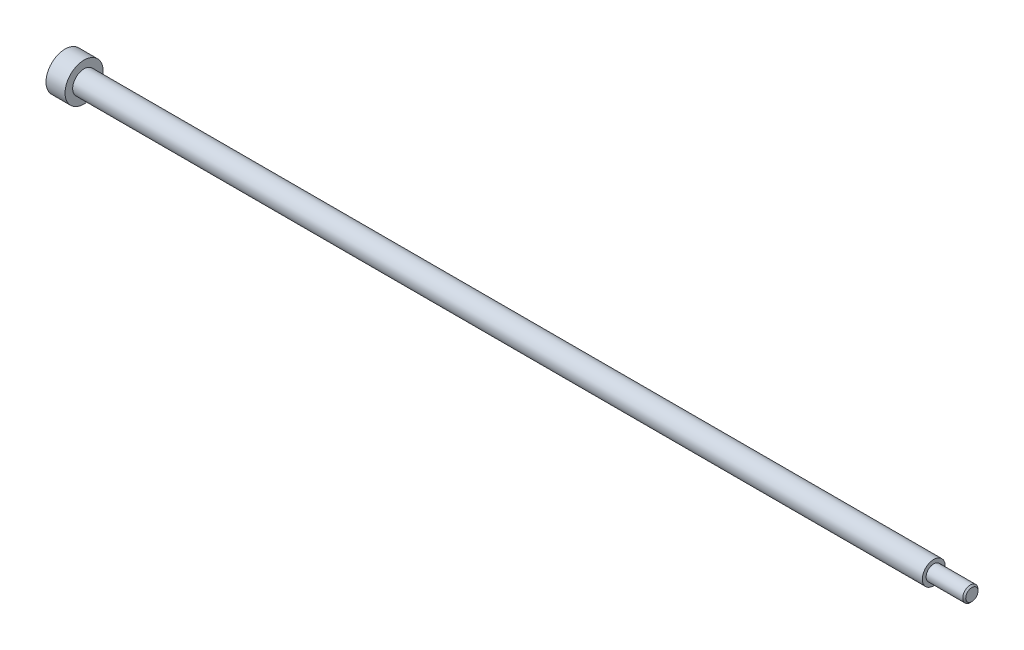
ISO-10303-21;
HEADER;
FILE_DESCRIPTION(('STEP AP214'),'2;1');
FILE_NAME('part.step','',(''),(''),'','','');
FILE_SCHEMA(('AUTOMOTIVE_DESIGN { 1 0 10303 214 1 1 1 1 }'));
ENDSEC;
DATA;
#1=APPLICATION_CONTEXT('core data for automotive mechanical design processes');
#2=APPLICATION_PROTOCOL_DEFINITION('international standard','automotive_design',2000,#1);
#3=PRODUCT_CONTEXT('',#1,'mechanical');
#4=PRODUCT('Part','Part','',(#3));
#5=PRODUCT_RELATED_PRODUCT_CATEGORY('part','',(#4));
#6=PRODUCT_DEFINITION_FORMATION('','',#4);
#7=PRODUCT_DEFINITION_CONTEXT('part definition',#1,'design');
#8=PRODUCT_DEFINITION('design','',#6,#7);
#9=PRODUCT_DEFINITION_SHAPE('','',#8);
#10=(LENGTH_UNIT() NAMED_UNIT(*) SI_UNIT(.MILLI.,.METRE.));
#11=(NAMED_UNIT(*) PLANE_ANGLE_UNIT() SI_UNIT($,.RADIAN.));
#12=(NAMED_UNIT(*) SI_UNIT($,.STERADIAN.) SOLID_ANGLE_UNIT());
#13=UNCERTAINTY_MEASURE_WITH_UNIT(LENGTH_MEASURE(1.E-05),#10,'distance_accuracy_value','');
#14=(GEOMETRIC_REPRESENTATION_CONTEXT(3) GLOBAL_UNCERTAINTY_ASSIGNED_CONTEXT((#13)) GLOBAL_UNIT_ASSIGNED_CONTEXT((#10,
#11,#12)) REPRESENTATION_CONTEXT('',''));
#15=CARTESIAN_POINT('',(0.,0.,0.));
#16=DIRECTION('',(0.,0.,1.));
#17=DIRECTION('',(1.,0.,0.));
#18=AXIS2_PLACEMENT_3D('',#15,#16,#17);
#19=CARTESIAN_POINT('',(0.,0.,0.));
#20=DIRECTION('',(-1.,0.,0.));
#21=DIRECTION('',(0.,-1.,0.));
#22=AXIS2_PLACEMENT_3D('',#19,#20,#21);
#23=PLANE('',#22);
#24=CARTESIAN_POINT('',(0.,0.,0.));
#25=DIRECTION('',(1.,0.,0.));
#26=DIRECTION('',(0.,1.,0.));
#27=AXIS2_PLACEMENT_3D('',#24,#25,#26);
#28=CIRCLE('',#27,5.);
#29=CARTESIAN_POINT('',(0.,5.00000000000001,0.));
#30=VERTEX_POINT('',#29);
#31=EDGE_CURVE('E10',#30,#30,#28,.T.);
#32=ORIENTED_EDGE('',*,*,#31,.F.);
#33=EDGE_LOOP('',(#32));
#34=FACE_BOUND('',#33,.T.);
#35=ADVANCED_FACE('F40',(#34),#23,.T.);
#36=CARTESIAN_POINT('',(227.999999999999,0.,0.));
#37=DIRECTION('',(1.,0.,0.));
#38=DIRECTION('',(0.,1.,0.));
#39=AXIS2_PLACEMENT_3D('',#36,#37,#38);
#40=CYLINDRICAL_SURFACE('',#39,5.00000000000001);
#41=ORIENTED_EDGE('',*,*,#31,.T.);
#42=EDGE_LOOP('',(#41));
#43=FACE_BOUND('',#42,.T.);
#44=CARTESIAN_POINT('',(5.,0.,0.));
#45=DIRECTION('',(1.,0.,0.));
#46=DIRECTION('',(0.,1.,0.));
#47=AXIS2_PLACEMENT_3D('',#44,#45,#46);
#48=CIRCLE('',#47,5.00000000000002);
#49=CARTESIAN_POINT('',(5.,5.00000000000002,0.));
#50=VERTEX_POINT('',#49);
#51=EDGE_CURVE('E47',#50,#50,#48,.T.);
#52=ORIENTED_EDGE('',*,*,#51,.F.);
#53=EDGE_LOOP('',(#52));
#54=FACE_BOUND('',#53,.T.);
#55=ADVANCED_FACE('F95',(#43,#54),#40,.T.);
#56=CARTESIAN_POINT('',(5.,4.99999999999998,2.22044604925031E-13));
#57=DIRECTION('',(1.,0.,0.));
#58=DIRECTION('',(0.,1.,0.));
#59=AXIS2_PLACEMENT_3D('',#56,#57,#58);
#60=PLANE('',#59);
#61=ORIENTED_EDGE('',*,*,#51,.T.);
#62=EDGE_LOOP('',(#61));
#63=FACE_BOUND('',#62,.T.);
#64=CARTESIAN_POINT('',(5.,0.,0.));
#65=DIRECTION('',(1.,0.,0.));
#66=DIRECTION('',(0.,1.,0.));
#67=AXIS2_PLACEMENT_3D('',#64,#65,#66);
#68=CIRCLE('',#67,3.00000000000002);
#69=CARTESIAN_POINT('',(5.,3.00000000000002,0.));
#70=VERTEX_POINT('',#69);
#71=EDGE_CURVE('E53',#70,#70,#68,.T.);
#72=ORIENTED_EDGE('',*,*,#71,.F.);
#73=EDGE_LOOP('',(#72));
#74=FACE_BOUND('',#73,.T.);
#75=ADVANCED_FACE('F100',(#63,#74),#60,.T.);
#76=CARTESIAN_POINT('',(227.999999999999,0.,0.));
#77=DIRECTION('',(1.,0.,0.));
#78=DIRECTION('',(0.,1.,0.));
#79=AXIS2_PLACEMENT_3D('',#76,#77,#78);
#80=CYLINDRICAL_SURFACE('',#79,3.00000000000001);
#81=ORIENTED_EDGE('',*,*,#71,.T.);
#82=EDGE_LOOP('',(#81));
#83=FACE_BOUND('',#82,.T.);
#84=CARTESIAN_POINT('',(227.999999999999,0.,0.));
#85=DIRECTION('',(1.,0.,0.));
#86=DIRECTION('',(0.,1.,0.));
#87=AXIS2_PLACEMENT_3D('',#84,#85,#86);
#88=CIRCLE('',#87,3.);
#89=CARTESIAN_POINT('',(227.999999999999,3.,0.));
#90=VERTEX_POINT('',#89);
#91=EDGE_CURVE('E59',#90,#90,#88,.T.);
#92=ORIENTED_EDGE('',*,*,#91,.F.);
#93=EDGE_LOOP('',(#92));
#94=FACE_BOUND('',#93,.T.);
#95=ADVANCED_FACE('F104',(#83,#94),#80,.T.);
#96=CARTESIAN_POINT('',(227.999999999999,3.00000000000006,0.));
#97=DIRECTION('',(1.,0.,0.));
#98=DIRECTION('',(0.,1.,0.));
#99=AXIS2_PLACEMENT_3D('',#96,#97,#98);
#100=PLANE('',#99);
#101=ORIENTED_EDGE('',*,*,#91,.T.);
#102=EDGE_LOOP('',(#101));
#103=FACE_BOUND('',#102,.T.);
#104=CARTESIAN_POINT('',(227.999999999999,0.,0.));
#105=DIRECTION('',(-1.,0.,0.));
#106=DIRECTION('',(0.,0.,1.));
#107=AXIS2_PLACEMENT_3D('',#104,#105,#106);
#108=CIRCLE('',#107,2.);
#109=CARTESIAN_POINT('',(227.999999999999,0.,2.));
#110=VERTEX_POINT('',#109);
#111=EDGE_CURVE('E65',#110,#110,#108,.T.);
#112=ORIENTED_EDGE('',*,*,#111,.T.);
#113=EDGE_LOOP('',(#112));
#114=FACE_BOUND('',#113,.T.);
#115=ADVANCED_FACE('F109',(#103,#114),#100,.T.);
#116=CARTESIAN_POINT('',(237.999999999999,0.,0.));
#117=DIRECTION('',(-1.,0.,0.));
#118=DIRECTION('',(0.,0.,1.));
#119=AXIS2_PLACEMENT_3D('',#116,#117,#118);
#120=CYLINDRICAL_SURFACE('',#119,2.);
#121=ORIENTED_EDGE('',*,*,#111,.F.);
#122=EDGE_LOOP('',(#121));
#123=FACE_BOUND('',#122,.T.);
#124=CARTESIAN_POINT('',(237.609999999999,0.,0.));
#125=DIRECTION('',(-1.,0.,0.));
#126=DIRECTION('',(0.,0.,1.));
#127=AXIS2_PLACEMENT_3D('',#124,#125,#126);
#128=CIRCLE('',#127,2.);
#129=CARTESIAN_POINT('',(237.609999999999,0.,2.));
#130=VERTEX_POINT('',#129);
#131=EDGE_CURVE('E73',#130,#130,#128,.T.);
#132=ORIENTED_EDGE('',*,*,#131,.T.);
#133=EDGE_LOOP('',(#132));
#134=FACE_BOUND('',#133,.T.);
#135=ADVANCED_FACE('F79',(#123,#134),#120,.T.);
#136=CARTESIAN_POINT('',(237.999999999999,0.,0.));
#137=DIRECTION('',(-1.,0.,0.));
#138=DIRECTION('',(0.,0.,1.));
#139=AXIS2_PLACEMENT_3D('',#136,#137,#138);
#140=CONICAL_SURFACE('',#139,1.61,0.785398163397445);
#141=ORIENTED_EDGE('',*,*,#131,.F.);
#142=EDGE_LOOP('',(#141));
#143=FACE_BOUND('',#142,.T.);
#144=CARTESIAN_POINT('',(237.999999999999,0.,0.));
#145=DIRECTION('',(-1.,0.,0.));
#146=DIRECTION('',(0.,0.,1.));
#147=AXIS2_PLACEMENT_3D('',#144,#145,#146);
#148=CIRCLE('',#147,1.61);
#149=CARTESIAN_POINT('',(237.999999999999,0.,1.61));
#150=VERTEX_POINT('',#149);
#151=EDGE_CURVE('E69',#150,#150,#148,.T.);
#152=ORIENTED_EDGE('',*,*,#151,.T.);
#153=EDGE_LOOP('',(#152));
#154=FACE_BOUND('',#153,.T.);
#155=ADVANCED_FACE('F81',(#143,#154),#140,.T.);
#156=CARTESIAN_POINT('',(237.999999999999,0.,0.));
#157=DIRECTION('',(1.,0.,0.));
#158=DIRECTION('',(0.,1.,0.));
#159=AXIS2_PLACEMENT_3D('',#156,#157,#158);
#160=PLANE('',#159);
#161=ORIENTED_EDGE('',*,*,#151,.F.);
#162=EDGE_LOOP('',(#161));
#163=FACE_BOUND('',#162,.T.);
#164=ADVANCED_FACE('F84',(#163),#160,.T.);
#165=CLOSED_SHELL('',(#35,#55,#75,#95,#115,#135,#155,#164));
#166=MANIFOLD_SOLID_BREP('B2',#165);
#167=ADVANCED_BREP_SHAPE_REPRESENTATION('',(#18,#166),#14);
#168=SHAPE_DEFINITION_REPRESENTATION(#9,#167);
ENDSEC;
END-ISO-10303-21;
